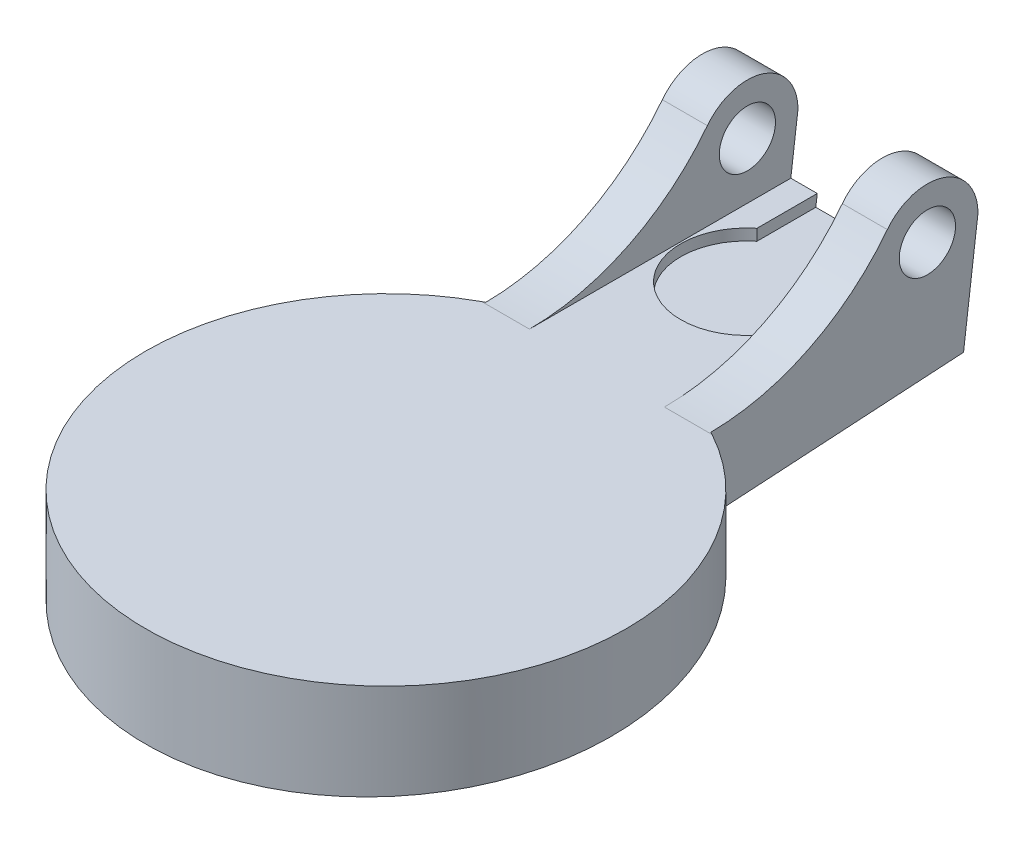
ISO-10303-21;
HEADER;
FILE_DESCRIPTION(('STEP AP214'),'2;1');
FILE_NAME('part.step','',(''),(''),'','','');
FILE_SCHEMA(('AUTOMOTIVE_DESIGN { 1 0 10303 214 1 1 1 1 }'));
ENDSEC;
DATA;
#1=APPLICATION_CONTEXT('core data for automotive mechanical design processes');
#2=APPLICATION_PROTOCOL_DEFINITION('international standard','automotive_design',2000,#1);
#3=PRODUCT_CONTEXT('',#1,'mechanical');
#4=PRODUCT('Part','Part','',(#3));
#5=PRODUCT_RELATED_PRODUCT_CATEGORY('part','',(#4));
#6=PRODUCT_DEFINITION_FORMATION('','',#4);
#7=PRODUCT_DEFINITION_CONTEXT('part definition',#1,'design');
#8=PRODUCT_DEFINITION('design','',#6,#7);
#9=PRODUCT_DEFINITION_SHAPE('','',#8);
#10=(LENGTH_UNIT() NAMED_UNIT(*) SI_UNIT(.MILLI.,.METRE.));
#11=(NAMED_UNIT(*) PLANE_ANGLE_UNIT() SI_UNIT($,.RADIAN.));
#12=(NAMED_UNIT(*) SI_UNIT($,.STERADIAN.) SOLID_ANGLE_UNIT());
#13=UNCERTAINTY_MEASURE_WITH_UNIT(LENGTH_MEASURE(1.E-05),#10,'distance_accuracy_value','');
#14=(GEOMETRIC_REPRESENTATION_CONTEXT(3) GLOBAL_UNCERTAINTY_ASSIGNED_CONTEXT((#13)) GLOBAL_UNIT_ASSIGNED_CONTEXT((#10,
#11,#12)) REPRESENTATION_CONTEXT('',''));
#15=CARTESIAN_POINT('',(0.,0.,0.));
#16=DIRECTION('',(0.,0.,1.));
#17=DIRECTION('',(1.,0.,0.));
#18=AXIS2_PLACEMENT_3D('',#15,#16,#17);
#19=CARTESIAN_POINT('',(0.,5.,6.31426982340599));
#20=DIRECTION('',(0.,-1.,0.));
#21=DIRECTION('',(0.,0.,-1.));
#22=AXIS2_PLACEMENT_3D('',#19,#20,#21);
#23=CYLINDRICAL_SURFACE('',#22,10.6840891318155);
#24=DIRECTION('',(0.,-1.,0.));
#25=VECTOR('',#24,1.);
#26=CARTESIAN_POINT('',(-5.,5.,-3.1276452671134));
#27=LINE('',#26,#25);
#28=CARTESIAN_POINT('',(-5.,5.00020054013543,-3.1276452671134));
#29=VERTEX_POINT('',#28);
#30=CARTESIAN_POINT('',(-5.,1.77972399035936,-3.12764526711341));
#31=VERTEX_POINT('',#30);
#32=EDGE_CURVE('E75',#29,#31,#27,.T.);
#33=ORIENTED_EDGE('',*,*,#32,.T.);
#34=CARTESIAN_POINT('',(0.,1.20689871030546,6.31426982340599));
#35=DIRECTION('',(0.,0.998164741139127,0.0605569942010037));
#36=DIRECTION('',(0.,-0.0605569942010037,0.998164741139127));
#37=AXIS2_PLACEMENT_3D('',#34,#35,#36);
#38=ELLIPSE('',#37,10.7037332531127,10.6840891318155);
#39=CARTESIAN_POINT('',(5.,1.77972399035936,-3.1276452671134));
#40=VERTEX_POINT('',#39);
#41=EDGE_CURVE('E174',#31,#40,#38,.T.);
#42=ORIENTED_EDGE('',*,*,#41,.T.);
#43=DIRECTION('',(0.,-1.,0.));
#44=VECTOR('',#43,1.);
#45=CARTESIAN_POINT('',(5.,5.,-3.1276452671134));
#46=LINE('',#45,#44);
#47=CARTESIAN_POINT('',(5.,5.00020054013543,-3.1276452671134));
#48=VERTEX_POINT('',#47);
#49=EDGE_CURVE('E83',#48,#40,#46,.T.);
#50=ORIENTED_EDGE('',*,*,#49,.F.);
#51=CARTESIAN_POINT('',(5.,5.00020054013543,-3.1276452671134));
#52=CARTESIAN_POINT('',(5.01969994844063,5.00013408352855,-3.11721308756641));
#53=CARTESIAN_POINT('',(5.03936688514742,5.00008414354716,-3.10671944937469));
#54=CARTESIAN_POINT('',(5.0786347350933,5.00001729683535,-3.08560925570181));
#55=CARTESIAN_POINT('',(5.0982356483324,5.00000039010493,-3.07499270022064));
#56=CARTESIAN_POINT('',(5.11780354983765,5.,-3.06431468609474));
#57=B_SPLINE_CURVE_WITH_KNOTS('',3,(#51,#52,#53,#54,#55,#56),.UNSPECIFIED.,.F.,.F.,(4,2,4),(0.,
0.0668742553107197,0.13374851062141),.UNSPECIFIED.);
#58=CARTESIAN_POINT('',(5.11780354983765,5.,-3.06431468609474));
#59=VERTEX_POINT('',#58);
#60=EDGE_CURVE('E225',#48,#59,#57,.T.);
#61=ORIENTED_EDGE('',*,*,#60,.T.);
#62=CARTESIAN_POINT('',(0.,5.,6.31426982340599));
#63=DIRECTION('',(0.,1.,0.));
#64=DIRECTION('',(0.,0.,1.));
#65=AXIS2_PLACEMENT_3D('',#62,#63,#64);
#66=CIRCLE('',#65,10.6840891318155);
#67=CARTESIAN_POINT('',(-5.11780354983765,5.,-3.06431468609474));
#68=VERTEX_POINT('',#67);
#69=EDGE_CURVE('E204',#68,#59,#66,.T.);
#70=ORIENTED_EDGE('',*,*,#69,.F.);
#71=CARTESIAN_POINT('',(-5.11780354983765,5.,-3.06431468609474));
#72=CARTESIAN_POINT('',(-5.0982356483324,5.00000039010493,-3.07499270022064));
#73=CARTESIAN_POINT('',(-5.0786347350933,5.00001729683535,-3.08560925570181));
#74=CARTESIAN_POINT('',(-5.03936688514742,5.00008414354716,-3.10671944937469));
#75=CARTESIAN_POINT('',(-5.01969994844063,5.00013408352855,-3.11721308756641));
#76=CARTESIAN_POINT('',(-5.,5.00020054013542,-3.1276452671134));
#77=B_SPLINE_CURVE_WITH_KNOTS('',3,(#71,#72,#73,#74,#75,#76),.UNSPECIFIED.,.F.,.F.,(4,2,4),(0.,
0.0668742553106904,0.13374851062141),.UNSPECIFIED.);
#78=EDGE_CURVE('E261',#68,#29,#77,.T.);
#79=ORIENTED_EDGE('',*,*,#78,.T.);
#80=EDGE_LOOP('',(#33,#42,#50,#61,#70,#79));
#81=FACE_BOUND('',#80,.T.);
#82=ADVANCED_FACE('F59',(#81),#23,.T.);
#83=CARTESIAN_POINT('',(0.,5.,0.));
#84=DIRECTION('',(0.,1.,0.));
#85=DIRECTION('',(0.,0.,1.));
#86=AXIS2_PLACEMENT_3D('',#83,#84,#85);
#87=PLANE('',#86);
#88=ORIENTED_EDGE('',*,*,#69,.T.);
#89=DIRECTION('',(-1.,0.,0.));
#90=VECTOR('',#89,1.);
#91=CARTESIAN_POINT('',(3.,5.,-3.06431468609474));
#92=LINE('',#91,#90);
#93=CARTESIAN_POINT('',(3.,5.,-3.06431468609474));
#94=VERTEX_POINT('',#93);
#95=EDGE_CURVE('E218',#59,#94,#92,.T.);
#96=ORIENTED_EDGE('',*,*,#95,.T.);
#97=DIRECTION('',(0.,0.,1.));
#98=VECTOR('',#97,1.);
#99=CARTESIAN_POINT('',(3.,5.,0.));
#100=LINE('',#99,#98);
#101=CARTESIAN_POINT('',(3.,5.,-14.6811200169852));
#102=VERTEX_POINT('',#101);
#103=EDGE_CURVE('E194',#102,#94,#100,.T.);
#104=ORIENTED_EDGE('',*,*,#103,.F.);
#105=DIRECTION('',(1.,0.,0.));
#106=VECTOR('',#105,1.);
#107=CARTESIAN_POINT('',(0.,5.,-14.6811200169852));
#108=LINE('',#107,#106);
#109=CARTESIAN_POINT('',(1.825,5.,-14.6811200169852));
#110=VERTEX_POINT('',#109);
#111=EDGE_CURVE('E538',#110,#102,#108,.T.);
#112=ORIENTED_EDGE('',*,*,#111,.F.);
#113=DIRECTION('',(0.,0.,1.));
#114=VECTOR('',#113,1.);
#115=CARTESIAN_POINT('',(1.825,5.,0.));
#116=LINE('',#115,#114);
#117=CARTESIAN_POINT('',(1.825,5.,-12.));
#118=VERTEX_POINT('',#117);
#119=EDGE_CURVE('E520',#110,#118,#116,.T.);
#120=ORIENTED_EDGE('',*,*,#119,.T.);
#121=CARTESIAN_POINT('',(0.,5.,-9.71417410986751));
#122=DIRECTION('',(0.,1.,0.));
#123=DIRECTION('',(0.,0.,1.));
#124=AXIS2_PLACEMENT_3D('',#121,#122,#123);
#125=CIRCLE('',#124,2.925);
#126=CARTESIAN_POINT('',(-1.825,5.,-12.));
#127=VERTEX_POINT('',#126);
#128=EDGE_CURVE('E517',#127,#118,#125,.T.);
#129=ORIENTED_EDGE('',*,*,#128,.F.);
#130=DIRECTION('',(0.,0.,1.));
#131=VECTOR('',#130,1.);
#132=CARTESIAN_POINT('',(-1.825,5.,0.));
#133=LINE('',#132,#131);
#134=CARTESIAN_POINT('',(-1.825,5.,-14.6811200169852));
#135=VERTEX_POINT('',#134);
#136=EDGE_CURVE('E523',#135,#127,#133,.T.);
#137=ORIENTED_EDGE('',*,*,#136,.F.);
#138=CARTESIAN_POINT('',(-3.,5.,-14.6811200169852));
#139=VERTEX_POINT('',#138);
#140=EDGE_CURVE('E535',#139,#135,#108,.T.);
#141=ORIENTED_EDGE('',*,*,#140,.F.);
#142=DIRECTION('',(0.,0.,-1.));
#143=VECTOR('',#142,1.);
#144=CARTESIAN_POINT('',(-3.,5.,0.));
#145=LINE('',#144,#143);
#146=CARTESIAN_POINT('',(-3.,5.,-3.06431468609474));
#147=VERTEX_POINT('',#146);
#148=EDGE_CURVE('E280',#147,#139,#145,.T.);
#149=ORIENTED_EDGE('',*,*,#148,.F.);
#150=DIRECTION('',(1.,0.,0.));
#151=VECTOR('',#150,1.);
#152=CARTESIAN_POINT('',(-5.,5.,-3.06431468609474));
#153=LINE('',#152,#151);
#154=EDGE_CURVE('E215',#147,#68,#153,.F.);
#155=ORIENTED_EDGE('',*,*,#154,.T.);
#156=EDGE_LOOP('',(#88,#96,#104,#112,#120,#129,#137,#141,#149,#155));
#157=FACE_BOUND('',#156,.T.);
#158=ADVANCED_FACE('F243',(#157),#87,.T.);
#159=CARTESIAN_POINT('',(5.,5.,15.));
#160=DIRECTION('',(-1.,0.,0.));
#161=DIRECTION('',(0.,0.,1.));
#162=AXIS2_PLACEMENT_3D('',#159,#160,#161);
#163=PLANE('',#162);
#164=DIRECTION('',(0.,0.0605569942010037,-0.998164741139127));
#165=VECTOR('',#164,1.);
#166=CARTESIAN_POINT('',(5.,0.695792180642397,14.7388708724982));
#167=LINE('',#166,#165);
#168=CARTESIAN_POINT('',(5.,2.46100641723783,-14.3572663247668));
#169=VERTEX_POINT('',#168);
#170=EDGE_CURVE('E183',#40,#169,#167,.T.);
#171=ORIENTED_EDGE('',*,*,#170,.T.);
#172=DIRECTION('',(0.,-0.99196317898837,0.126526880666863));
#173=VECTOR('',#172,1.);
#174=CARTESIAN_POINT('',(5.,7.5,-15.));
#175=LINE('',#174,#173);
#176=CARTESIAN_POINT('',(5.,7.5,-15.));
#177=VERTEX_POINT('',#176);
#178=EDGE_CURVE('E166',#177,#169,#175,.T.);
#179=ORIENTED_EDGE('',*,*,#178,.F.);
#180=CARTESIAN_POINT('',(5.,7.5,-12.75));
#181=DIRECTION('',(1.,0.,0.));
#182=DIRECTION('',(0.,0.,-1.));
#183=AXIS2_PLACEMENT_3D('',#180,#181,#182);
#184=CIRCLE('',#183,2.25);
#185=CARTESIAN_POINT('',(5.,8.87755102040817,-10.970996574997));
#186=VERTEX_POINT('',#185);
#187=EDGE_CURVE('E182',#177,#186,#184,.T.);
#188=ORIENTED_EDGE('',*,*,#187,.T.);
#189=CARTESIAN_POINT('',(5.,15.,-3.06431468609474));
#190=DIRECTION('',(-1.,0.,0.));
#191=DIRECTION('',(0.,0.,1.));
#192=AXIS2_PLACEMENT_3D('',#189,#190,#191);
#193=CIRCLE('',#192,10.);
#194=EDGE_CURVE('E223',#186,#48,#193,.T.);
#195=ORIENTED_EDGE('',*,*,#194,.T.);
#196=ORIENTED_EDGE('',*,*,#49,.T.);
#197=EDGE_LOOP('',(#171,#179,#188,#195,#196));
#198=FACE_BOUND('',#197,.T.);
#199=CARTESIAN_POINT('',(5.,7.5,-12.75));
#200=DIRECTION('',(1.,0.,0.));
#201=DIRECTION('',(0.,0.,-1.));
#202=AXIS2_PLACEMENT_3D('',#199,#200,#201);
#203=CIRCLE('',#202,1.25);
#204=CARTESIAN_POINT('',(5.,7.5,-14.));
#205=VERTEX_POINT('',#204);
#206=EDGE_CURVE('E190',#205,#205,#203,.T.);
#207=ORIENTED_EDGE('',*,*,#206,.F.);
#208=EDGE_LOOP('',(#207));
#209=FACE_BOUND('',#208,.T.);
#210=ADVANCED_FACE('F180',(#198,#209),#163,.F.);
#211=CARTESIAN_POINT('',(-5.,5.,15.));
#212=DIRECTION('',(-1.,0.,0.));
#213=DIRECTION('',(0.,0.,1.));
#214=AXIS2_PLACEMENT_3D('',#211,#212,#213);
#215=PLANE('',#214);
#216=DIRECTION('',(0.,0.99196317898837,-0.126526880666863));
#217=VECTOR('',#216,1.);
#218=CARTESIAN_POINT('',(-5.,1.2747224256147,-14.2059534371269));
#219=LINE('',#218,#217);
#220=CARTESIAN_POINT('',(-5.,2.46100641723783,-14.3572663247668));
#221=VERTEX_POINT('',#220);
#222=CARTESIAN_POINT('',(-5.,7.5,-15.));
#223=VERTEX_POINT('',#222);
#224=EDGE_CURVE('E521',#221,#223,#219,.T.);
#225=ORIENTED_EDGE('',*,*,#224,.F.);
#226=DIRECTION('',(0.,0.0605569942010037,-0.998164741139127));
#227=VECTOR('',#226,1.);
#228=CARTESIAN_POINT('',(-5.,0.695792180642397,14.7388708724982));
#229=LINE('',#228,#227);
#230=EDGE_CURVE('E209',#31,#221,#229,.T.);
#231=ORIENTED_EDGE('',*,*,#230,.F.);
#232=ORIENTED_EDGE('',*,*,#32,.F.);
#233=CARTESIAN_POINT('',(-5.,15.,-3.06431468609474));
#234=DIRECTION('',(-1.,0.,0.));
#235=DIRECTION('',(0.,0.,1.));
#236=AXIS2_PLACEMENT_3D('',#233,#234,#235);
#237=CIRCLE('',#236,10.);
#238=CARTESIAN_POINT('',(-5.,8.87755102040817,-10.970996574997));
#239=VERTEX_POINT('',#238);
#240=EDGE_CURVE('E68',#29,#239,#237,.F.);
#241=ORIENTED_EDGE('',*,*,#240,.T.);
#242=CARTESIAN_POINT('',(-5.,7.5,-12.75));
#243=DIRECTION('',(-1.,0.,0.));
#244=DIRECTION('',(0.,0.,1.));
#245=AXIS2_PLACEMENT_3D('',#242,#243,#244);
#246=CIRCLE('',#245,2.25);
#247=EDGE_CURVE('E271',#239,#223,#246,.T.);
#248=ORIENTED_EDGE('',*,*,#247,.T.);
#249=EDGE_LOOP('',(#225,#231,#232,#241,#248));
#250=FACE_BOUND('',#249,.T.);
#251=CARTESIAN_POINT('',(-5.,7.5,-12.75));
#252=DIRECTION('',(-1.,0.,0.));
#253=DIRECTION('',(0.,0.,1.));
#254=AXIS2_PLACEMENT_3D('',#251,#252,#253);
#255=CIRCLE('',#254,1.25);
#256=CARTESIAN_POINT('',(-5.,7.5,-11.5));
#257=VERTEX_POINT('',#256);
#258=EDGE_CURVE('E276',#257,#257,#255,.T.);
#259=ORIENTED_EDGE('',*,*,#258,.F.);
#260=EDGE_LOOP('',(#259));
#261=FACE_BOUND('',#260,.T.);
#262=ADVANCED_FACE('F242',(#250,#261),#215,.T.);
#263=CARTESIAN_POINT('',(10.6840891318155,2.5,-15.));
#264=DIRECTION('',(0.,0.998164741139127,0.0605569942010037));
#265=DIRECTION('',(0.,-0.0605569942010037,0.998164741139127));
#266=AXIS2_PLACEMENT_3D('',#263,#264,#265);
#267=PLANE('',#266);
#268=ORIENTED_EDGE('',*,*,#230,.T.);
#269=DIRECTION('',(1.,0.,0.));
#270=VECTOR('',#269,1.);
#271=CARTESIAN_POINT('',(-10.6840891318155,2.46100641723783,-14.3572663247668));
#272=LINE('',#271,#270);
#273=EDGE_CURVE('E184',#221,#169,#272,.T.);
#274=ORIENTED_EDGE('',*,*,#273,.T.);
#275=ORIENTED_EDGE('',*,*,#170,.F.);
#276=ORIENTED_EDGE('',*,*,#41,.F.);
#277=EDGE_LOOP('',(#268,#274,#275,#276));
#278=FACE_BOUND('',#277,.T.);
#279=ADVANCED_FACE('F245',(#278),#267,.F.);
#280=CARTESIAN_POINT('',(3.,7.5,-12.75));
#281=DIRECTION('',(1.,0.,0.));
#282=DIRECTION('',(0.,0.,-1.));
#283=AXIS2_PLACEMENT_3D('',#280,#281,#282);
#284=CYLINDRICAL_SURFACE('',#283,2.25);
#285=CARTESIAN_POINT('',(3.,7.5,-12.75));
#286=DIRECTION('',(1.,0.,0.));
#287=DIRECTION('',(0.,0.,-1.));
#288=AXIS2_PLACEMENT_3D('',#285,#286,#287);
#289=CIRCLE('',#288,2.25);
#290=CARTESIAN_POINT('',(3.,7.5,-15.));
#291=VERTEX_POINT('',#290);
#292=CARTESIAN_POINT('',(3.,8.87755102040817,-10.970996574997));
#293=VERTEX_POINT('',#292);
#294=EDGE_CURVE('E288',#291,#293,#289,.T.);
#295=ORIENTED_EDGE('',*,*,#294,.T.);
#296=DIRECTION('',(1.,0.,0.));
#297=VECTOR('',#296,1.);
#298=CARTESIAN_POINT('',(3.,8.87755102040817,-10.970996574997));
#299=LINE('',#298,#297);
#300=EDGE_CURVE('E189',#293,#186,#299,.T.);
#301=ORIENTED_EDGE('',*,*,#300,.T.);
#302=ORIENTED_EDGE('',*,*,#187,.F.);
#303=DIRECTION('',(1.,0.,0.));
#304=VECTOR('',#303,1.);
#305=CARTESIAN_POINT('',(3.,7.5,-15.));
#306=LINE('',#305,#304);
#307=EDGE_CURVE('E162',#291,#177,#306,.T.);
#308=ORIENTED_EDGE('',*,*,#307,.F.);
#309=EDGE_LOOP('',(#295,#301,#302,#308));
#310=FACE_BOUND('',#309,.T.);
#311=ADVANCED_FACE('F187',(#310),#284,.T.);
#312=CARTESIAN_POINT('',(3.,7.5,-12.75));
#313=DIRECTION('',(1.,0.,0.));
#314=DIRECTION('',(0.,0.,-1.));
#315=AXIS2_PLACEMENT_3D('',#312,#313,#314);
#316=CYLINDRICAL_SURFACE('',#315,1.25);
#317=CARTESIAN_POINT('',(3.,7.5,-12.75));
#318=DIRECTION('',(1.,0.,0.));
#319=DIRECTION('',(0.,0.,-1.));
#320=AXIS2_PLACEMENT_3D('',#317,#318,#319);
#321=CIRCLE('',#320,1.25);
#322=CARTESIAN_POINT('',(3.,7.5,-14.));
#323=VERTEX_POINT('',#322);
#324=EDGE_CURVE('E175',#323,#323,#321,.T.);
#325=ORIENTED_EDGE('',*,*,#324,.F.);
#326=EDGE_LOOP('',(#325));
#327=FACE_BOUND('',#326,.T.);
#328=ORIENTED_EDGE('',*,*,#206,.T.);
#329=EDGE_LOOP('',(#328));
#330=FACE_BOUND('',#329,.T.);
#331=ADVANCED_FACE('F294',(#327,#330),#316,.F.);
#332=CARTESIAN_POINT('',(3.,0.,0.));
#333=DIRECTION('',(1.,0.,0.));
#334=DIRECTION('',(0.,0.,-1.));
#335=AXIS2_PLACEMENT_3D('',#332,#333,#334);
#336=PLANE('',#335);
#337=ORIENTED_EDGE('',*,*,#294,.F.);
#338=DIRECTION('',(0.,-0.99196317898837,0.126526880666863));
#339=VECTOR('',#338,1.);
#340=CARTESIAN_POINT('',(3.,-1.76258221512211,-13.8185391762273));
#341=LINE('',#340,#339);
#342=EDGE_CURVE('E169',#291,#102,#341,.T.);
#343=ORIENTED_EDGE('',*,*,#342,.T.);
#344=ORIENTED_EDGE('',*,*,#103,.T.);
#345=CARTESIAN_POINT('',(3.,15.,-3.06431468609474));
#346=DIRECTION('',(1.,0.,0.));
#347=DIRECTION('',(0.,0.,-1.));
#348=AXIS2_PLACEMENT_3D('',#345,#346,#347);
#349=CIRCLE('',#348,10.);
#350=EDGE_CURVE('E231',#94,#293,#349,.T.);
#351=ORIENTED_EDGE('',*,*,#350,.T.);
#352=EDGE_LOOP('',(#337,#343,#344,#351));
#353=FACE_BOUND('',#352,.T.);
#354=ORIENTED_EDGE('',*,*,#324,.T.);
#355=EDGE_LOOP('',(#354));
#356=FACE_BOUND('',#355,.T.);
#357=ADVANCED_FACE('F292',(#353,#356),#336,.F.);
#358=CARTESIAN_POINT('',(-3.,7.5,-12.75));
#359=DIRECTION('',(-1.,0.,0.));
#360=DIRECTION('',(0.,0.,1.));
#361=AXIS2_PLACEMENT_3D('',#358,#359,#360);
#362=CYLINDRICAL_SURFACE('',#361,2.25);
#363=ORIENTED_EDGE('',*,*,#247,.F.);
#364=DIRECTION('',(-1.,0.,0.));
#365=VECTOR('',#364,1.);
#366=CARTESIAN_POINT('',(-3.,8.87755102040817,-10.970996574997));
#367=LINE('',#366,#365);
#368=CARTESIAN_POINT('',(-3.,8.87755102040817,-10.970996574997));
#369=VERTEX_POINT('',#368);
#370=EDGE_CURVE('E221',#239,#369,#367,.F.);
#371=ORIENTED_EDGE('',*,*,#370,.T.);
#372=CARTESIAN_POINT('',(-3.,7.5,-12.75));
#373=DIRECTION('',(-1.,0.,0.));
#374=DIRECTION('',(0.,0.,1.));
#375=AXIS2_PLACEMENT_3D('',#372,#373,#374);
#376=CIRCLE('',#375,2.25);
#377=CARTESIAN_POINT('',(-3.,7.5,-15.));
#378=VERTEX_POINT('',#377);
#379=EDGE_CURVE('E526',#369,#378,#376,.T.);
#380=ORIENTED_EDGE('',*,*,#379,.T.);
#381=DIRECTION('',(-1.,0.,0.));
#382=VECTOR('',#381,1.);
#383=CARTESIAN_POINT('',(-3.,7.5,-15.));
#384=LINE('',#383,#382);
#385=EDGE_CURVE('E191',#378,#223,#384,.T.);
#386=ORIENTED_EDGE('',*,*,#385,.T.);
#387=EDGE_LOOP('',(#363,#371,#380,#386));
#388=FACE_BOUND('',#387,.T.);
#389=ADVANCED_FACE('F273',(#388),#362,.T.);
#390=CARTESIAN_POINT('',(-3.,7.5,-12.75));
#391=DIRECTION('',(-1.,0.,0.));
#392=DIRECTION('',(0.,0.,1.));
#393=AXIS2_PLACEMENT_3D('',#390,#391,#392);
#394=CYLINDRICAL_SURFACE('',#393,1.25);
#395=CARTESIAN_POINT('',(-3.,7.5,-12.75));
#396=DIRECTION('',(-1.,0.,0.));
#397=DIRECTION('',(0.,0.,1.));
#398=AXIS2_PLACEMENT_3D('',#395,#396,#397);
#399=CIRCLE('',#398,1.25);
#400=CARTESIAN_POINT('',(-3.,7.5,-11.5));
#401=VERTEX_POINT('',#400);
#402=EDGE_CURVE('E197',#401,#401,#399,.T.);
#403=ORIENTED_EDGE('',*,*,#402,.F.);
#404=EDGE_LOOP('',(#403));
#405=FACE_BOUND('',#404,.T.);
#406=ORIENTED_EDGE('',*,*,#258,.T.);
#407=EDGE_LOOP('',(#406));
#408=FACE_BOUND('',#407,.T.);
#409=ADVANCED_FACE('F310',(#405,#408),#394,.F.);
#410=CARTESIAN_POINT('',(-3.,0.,0.));
#411=DIRECTION('',(-1.,0.,0.));
#412=DIRECTION('',(0.,0.,1.));
#413=AXIS2_PLACEMENT_3D('',#410,#411,#412);
#414=PLANE('',#413);
#415=ORIENTED_EDGE('',*,*,#148,.T.);
#416=DIRECTION('',(0.,0.99196317898837,-0.126526880666863));
#417=VECTOR('',#416,1.);
#418=CARTESIAN_POINT('',(-3.,-1.76258221512211,-13.8185391762273));
#419=LINE('',#418,#417);
#420=EDGE_CURVE('E533',#139,#378,#419,.T.);
#421=ORIENTED_EDGE('',*,*,#420,.T.);
#422=ORIENTED_EDGE('',*,*,#379,.F.);
#423=CARTESIAN_POINT('',(-3.,15.,-3.06431468609474));
#424=DIRECTION('',(-1.,0.,0.));
#425=DIRECTION('',(0.,0.,1.));
#426=AXIS2_PLACEMENT_3D('',#423,#424,#425);
#427=CIRCLE('',#426,10.);
#428=EDGE_CURVE('E12',#369,#147,#427,.T.);
#429=ORIENTED_EDGE('',*,*,#428,.T.);
#430=EDGE_LOOP('',(#415,#421,#422,#429));
#431=FACE_BOUND('',#430,.T.);
#432=ORIENTED_EDGE('',*,*,#402,.T.);
#433=EDGE_LOOP('',(#432));
#434=FACE_BOUND('',#433,.T.);
#435=ADVANCED_FACE('F313',(#431,#434),#414,.F.);
#436=CARTESIAN_POINT('',(0.,4.5,-9.71417410986751));
#437=DIRECTION('',(0.,1.,0.));
#438=DIRECTION('',(0.,0.,1.));
#439=AXIS2_PLACEMENT_3D('',#436,#437,#438);
#440=CYLINDRICAL_SURFACE('',#439,2.925);
#441=ORIENTED_EDGE('',*,*,#128,.T.);
#442=DIRECTION('',(0.,1.,0.));
#443=VECTOR('',#442,1.);
#444=CARTESIAN_POINT('',(1.825,4.5,-12.));
#445=LINE('',#444,#443);
#446=CARTESIAN_POINT('',(1.825,4.5,-12.));
#447=VERTEX_POINT('',#446);
#448=EDGE_CURVE('E283',#447,#118,#445,.T.);
#449=ORIENTED_EDGE('',*,*,#448,.F.);
#450=CARTESIAN_POINT('',(0.,4.5,-9.71417410986751));
#451=DIRECTION('',(0.,1.,0.));
#452=DIRECTION('',(0.,0.,1.));
#453=AXIS2_PLACEMENT_3D('',#450,#451,#452);
#454=CIRCLE('',#453,2.925);
#455=CARTESIAN_POINT('',(-1.825,4.5,-12.));
#456=VERTEX_POINT('',#455);
#457=EDGE_CURVE('E513',#456,#447,#454,.T.);
#458=ORIENTED_EDGE('',*,*,#457,.F.);
#459=DIRECTION('',(0.,1.,0.));
#460=VECTOR('',#459,1.);
#461=CARTESIAN_POINT('',(-1.825,4.5,-12.));
#462=LINE('',#461,#460);
#463=EDGE_CURVE('E277',#456,#127,#462,.T.);
#464=ORIENTED_EDGE('',*,*,#463,.T.);
#465=EDGE_LOOP('',(#441,#449,#458,#464));
#466=FACE_BOUND('',#465,.T.);
#467=ADVANCED_FACE('F317',(#466),#440,.F.);
#468=CARTESIAN_POINT('',(-1.825,4.5,0.));
#469=DIRECTION('',(-1.,0.,0.));
#470=DIRECTION('',(0.,0.,1.));
#471=AXIS2_PLACEMENT_3D('',#468,#469,#470);
#472=PLANE('',#471);
#473=DIRECTION('',(0.,0.,1.));
#474=VECTOR('',#473,1.);
#475=CARTESIAN_POINT('',(-1.825,4.5,0.));
#476=LINE('',#475,#474);
#477=CARTESIAN_POINT('',(-1.825,4.5,-14.6173440203822));
#478=VERTEX_POINT('',#477);
#479=EDGE_CURVE('E502',#478,#456,#476,.T.);
#480=ORIENTED_EDGE('',*,*,#479,.F.);
#481=DIRECTION('',(0.,0.99196317898837,-0.126526880666863));
#482=VECTOR('',#481,1.);
#483=CARTESIAN_POINT('',(-1.825,2.6653770529871,-14.3833342067093));
#484=LINE('',#483,#482);
#485=EDGE_CURVE('E507',#478,#135,#484,.T.);
#486=ORIENTED_EDGE('',*,*,#485,.T.);
#487=ORIENTED_EDGE('',*,*,#136,.T.);
#488=ORIENTED_EDGE('',*,*,#463,.F.);
#489=EDGE_LOOP('',(#480,#486,#487,#488));
#490=FACE_BOUND('',#489,.T.);
#491=ADVANCED_FACE('F321',(#490),#472,.F.);
#492=CARTESIAN_POINT('',(1.825,4.5,0.));
#493=DIRECTION('',(-1.,0.,0.));
#494=DIRECTION('',(0.,0.,1.));
#495=AXIS2_PLACEMENT_3D('',#492,#493,#494);
#496=PLANE('',#495);
#497=DIRECTION('',(0.,0.99196317898837,-0.126526880666863));
#498=VECTOR('',#497,1.);
#499=CARTESIAN_POINT('',(1.825,2.6653770529871,-14.3833342067093));
#500=LINE('',#499,#498);
#501=CARTESIAN_POINT('',(1.825,4.5,-14.6173440203822));
#502=VERTEX_POINT('',#501);
#503=EDGE_CURVE('E545',#502,#110,#500,.T.);
#504=ORIENTED_EDGE('',*,*,#503,.F.);
#505=DIRECTION('',(0.,0.,1.));
#506=VECTOR('',#505,1.);
#507=CARTESIAN_POINT('',(1.825,4.5,0.));
#508=LINE('',#507,#506);
#509=EDGE_CURVE('E504',#502,#447,#508,.T.);
#510=ORIENTED_EDGE('',*,*,#509,.T.);
#511=ORIENTED_EDGE('',*,*,#448,.T.);
#512=ORIENTED_EDGE('',*,*,#119,.F.);
#513=EDGE_LOOP('',(#504,#510,#511,#512));
#514=FACE_BOUND('',#513,.T.);
#515=ADVANCED_FACE('F323',(#514),#496,.T.);
#516=CARTESIAN_POINT('',(0.,4.5,0.));
#517=DIRECTION('',(0.,1.,0.));
#518=DIRECTION('',(0.,0.,1.));
#519=AXIS2_PLACEMENT_3D('',#516,#517,#518);
#520=PLANE('',#519);
#521=DIRECTION('',(1.,0.,0.));
#522=VECTOR('',#521,1.);
#523=CARTESIAN_POINT('',(0.,4.5,-14.6173440203822));
#524=LINE('',#523,#522);
#525=EDGE_CURVE('E212',#478,#502,#524,.T.);
#526=ORIENTED_EDGE('',*,*,#525,.F.);
#527=ORIENTED_EDGE('',*,*,#479,.T.);
#528=ORIENTED_EDGE('',*,*,#457,.T.);
#529=ORIENTED_EDGE('',*,*,#509,.F.);
#530=EDGE_LOOP('',(#526,#527,#528,#529));
#531=FACE_BOUND('',#530,.T.);
#532=ADVANCED_FACE('F326',(#531),#520,.T.);
#533=CARTESIAN_POINT('',(-10.6840891318155,7.5,-15.));
#534=DIRECTION('',(0.,0.126526880666863,0.99196317898837));
#535=DIRECTION('',(0.,-0.99196317898837,0.126526880666863));
#536=AXIS2_PLACEMENT_3D('',#533,#534,#535);
#537=PLANE('',#536);
#538=ORIENTED_EDGE('',*,*,#224,.T.);
#539=ORIENTED_EDGE('',*,*,#385,.F.);
#540=ORIENTED_EDGE('',*,*,#420,.F.);
#541=ORIENTED_EDGE('',*,*,#140,.T.);
#542=ORIENTED_EDGE('',*,*,#485,.F.);
#543=ORIENTED_EDGE('',*,*,#525,.T.);
#544=ORIENTED_EDGE('',*,*,#503,.T.);
#545=ORIENTED_EDGE('',*,*,#111,.T.);
#546=ORIENTED_EDGE('',*,*,#342,.F.);
#547=ORIENTED_EDGE('',*,*,#307,.T.);
#548=ORIENTED_EDGE('',*,*,#178,.T.);
#549=ORIENTED_EDGE('',*,*,#273,.F.);
#550=EDGE_LOOP('',(#538,#539,#540,#541,#542,#543,#544,#545,#546,#547,#548,#549));
#551=FACE_BOUND('',#550,.T.);
#552=ADVANCED_FACE('F165',(#551),#537,.F.);
#553=CARTESIAN_POINT('',(3.,15.,-3.06431468609474));
#554=DIRECTION('',(1.,0.,0.));
#555=DIRECTION('',(0.,0.,-1.));
#556=AXIS2_PLACEMENT_3D('',#553,#554,#555);
#557=CYLINDRICAL_SURFACE('',#556,10.);
#558=ORIENTED_EDGE('',*,*,#350,.F.);
#559=ORIENTED_EDGE('',*,*,#95,.F.);
#560=ORIENTED_EDGE('',*,*,#60,.F.);
#561=ORIENTED_EDGE('',*,*,#194,.F.);
#562=ORIENTED_EDGE('',*,*,#300,.F.);
#563=EDGE_LOOP('',(#558,#559,#560,#561,#562));
#564=FACE_BOUND('',#563,.T.);
#565=ADVANCED_FACE('F236',(#564),#557,.F.);
#566=CARTESIAN_POINT('',(-3.,15.,-3.06431468609474));
#567=DIRECTION('',(-1.,0.,0.));
#568=DIRECTION('',(0.,0.,1.));
#569=AXIS2_PLACEMENT_3D('',#566,#567,#568);
#570=CYLINDRICAL_SURFACE('',#569,10.);
#571=ORIENTED_EDGE('',*,*,#428,.F.);
#572=ORIENTED_EDGE('',*,*,#370,.F.);
#573=ORIENTED_EDGE('',*,*,#240,.F.);
#574=ORIENTED_EDGE('',*,*,#78,.F.);
#575=ORIENTED_EDGE('',*,*,#154,.F.);
#576=EDGE_LOOP('',(#571,#572,#573,#574,#575));
#577=FACE_BOUND('',#576,.T.);
#578=ADVANCED_FACE('F61',(#577),#570,.F.);
#579=CLOSED_SHELL('',(#82,#158,#210,#262,#279,#311,#331,#357,#389,#409,#435,#467,#491,#515,#532,
#552,#565,#578));
#580=MANIFOLD_SOLID_BREP('B2',#579);
#581=ADVANCED_BREP_SHAPE_REPRESENTATION('',(#18,#580),#14);
#582=SHAPE_DEFINITION_REPRESENTATION(#9,#581);
ENDSEC;
END-ISO-10303-21;
